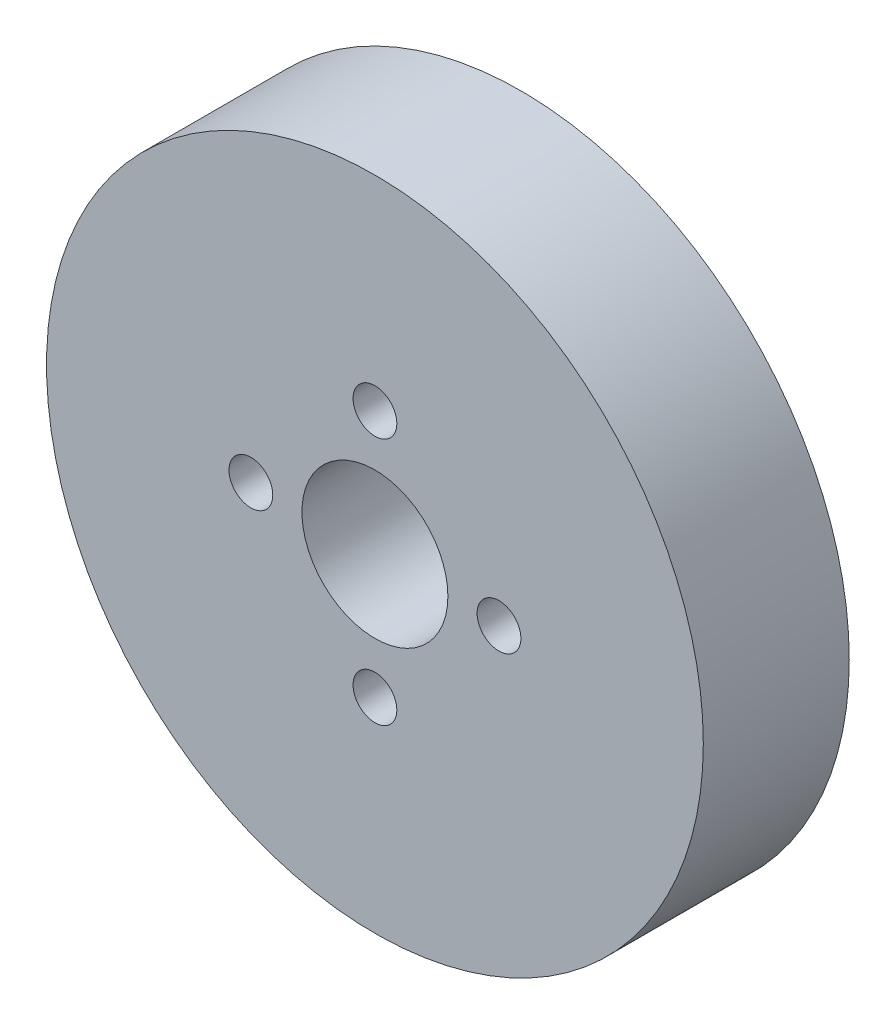
ISO-10303-21;
HEADER;
FILE_DESCRIPTION(('STEP AP214'),'2;1');
FILE_NAME('part.step','',(''),(''),'','','');
FILE_SCHEMA(('AUTOMOTIVE_DESIGN { 1 0 10303 214 1 1 1 1 }'));
ENDSEC;
DATA;
#1=APPLICATION_CONTEXT('core data for automotive mechanical design processes');
#2=APPLICATION_PROTOCOL_DEFINITION('international standard','automotive_design',2000,#1);
#3=PRODUCT_CONTEXT('',#1,'mechanical');
#4=PRODUCT('Part','Part','',(#3));
#5=PRODUCT_RELATED_PRODUCT_CATEGORY('part','',(#4));
#6=PRODUCT_DEFINITION_FORMATION('','',#4);
#7=PRODUCT_DEFINITION_CONTEXT('part definition',#1,'design');
#8=PRODUCT_DEFINITION('design','',#6,#7);
#9=PRODUCT_DEFINITION_SHAPE('','',#8);
#10=(LENGTH_UNIT() NAMED_UNIT(*) SI_UNIT(.MILLI.,.METRE.));
#11=(NAMED_UNIT(*) PLANE_ANGLE_UNIT() SI_UNIT($,.RADIAN.));
#12=(NAMED_UNIT(*) SI_UNIT($,.STERADIAN.) SOLID_ANGLE_UNIT());
#13=UNCERTAINTY_MEASURE_WITH_UNIT(LENGTH_MEASURE(1.E-05),#10,'distance_accuracy_value','');
#14=(GEOMETRIC_REPRESENTATION_CONTEXT(3) GLOBAL_UNCERTAINTY_ASSIGNED_CONTEXT((#13)) GLOBAL_UNIT_ASSIGNED_CONTEXT((#10,
#11,#12)) REPRESENTATION_CONTEXT('',''));
#15=CARTESIAN_POINT('',(0.,0.,0.));
#16=DIRECTION('',(0.,0.,1.));
#17=DIRECTION('',(1.,0.,0.));
#18=AXIS2_PLACEMENT_3D('',#15,#16,#17);
#19=CARTESIAN_POINT('',(0.,0.,10.));
#20=DIRECTION('',(0.,0.,1.));
#21=DIRECTION('',(1.,0.,0.));
#22=AXIS2_PLACEMENT_3D('',#19,#20,#21);
#23=PLANE('',#22);
#24=CARTESIAN_POINT('',(0.,8.5,10.));
#25=DIRECTION('',(0.,0.,1.));
#26=DIRECTION('',(1.,0.,0.));
#27=AXIS2_PLACEMENT_3D('',#24,#25,#26);
#28=CIRCLE('',#27,1.5);
#29=CARTESIAN_POINT('',(1.5,8.5,10.));
#30=VERTEX_POINT('',#29);
#31=EDGE_CURVE('E72',#30,#30,#28,.T.);
#32=ORIENTED_EDGE('',*,*,#31,.F.);
#33=EDGE_LOOP('',(#32));
#34=FACE_BOUND('',#33,.T.);
#35=CARTESIAN_POINT('',(8.50000000000023,2.26424574173893E-13,10.));
#36=DIRECTION('',(0.,0.,1.));
#37=DIRECTION('',(1.,0.,0.));
#38=AXIS2_PLACEMENT_3D('',#35,#36,#37);
#39=CIRCLE('',#38,1.5);
#40=CARTESIAN_POINT('',(10.0000000000002,2.26424574173893E-13,10.));
#41=VERTEX_POINT('',#40);
#42=EDGE_CURVE('E66',#41,#41,#39,.T.);
#43=ORIENTED_EDGE('',*,*,#42,.F.);
#44=EDGE_LOOP('',(#43));
#45=FACE_BOUND('',#44,.T.);
#46=CARTESIAN_POINT('',(4.52849148347786E-13,-8.5,10.));
#47=DIRECTION('',(0.,0.,1.));
#48=DIRECTION('',(1.,0.,0.));
#49=AXIS2_PLACEMENT_3D('',#46,#47,#48);
#50=CIRCLE('',#49,1.5);
#51=CARTESIAN_POINT('',(1.50000000000045,-8.5,10.));
#52=VERTEX_POINT('',#51);
#53=EDGE_CURVE('E60',#52,#52,#50,.T.);
#54=ORIENTED_EDGE('',*,*,#53,.F.);
#55=EDGE_LOOP('',(#54));
#56=FACE_BOUND('',#55,.T.);
#57=CARTESIAN_POINT('',(-8.49999999999977,-2.25383624394618E-13,10.));
#58=DIRECTION('',(0.,0.,1.));
#59=DIRECTION('',(1.,0.,0.));
#60=AXIS2_PLACEMENT_3D('',#57,#58,#59);
#61=CIRCLE('',#60,1.5);
#62=CARTESIAN_POINT('',(-6.99999999999978,-2.25383624394618E-13,10.));
#63=VERTEX_POINT('',#62);
#64=EDGE_CURVE('E54',#63,#63,#61,.T.);
#65=ORIENTED_EDGE('',*,*,#64,.F.);
#66=EDGE_LOOP('',(#65));
#67=FACE_BOUND('',#66,.T.);
#68=CARTESIAN_POINT('',(0.,0.,10.));
#69=DIRECTION('',(0.,0.,1.));
#70=DIRECTION('',(1.,0.,0.));
#71=AXIS2_PLACEMENT_3D('',#68,#69,#70);
#72=CIRCLE('',#71,22.5);
#73=CARTESIAN_POINT('',(22.5,0.,10.));
#74=VERTEX_POINT('',#73);
#75=EDGE_CURVE('E10',#74,#74,#72,.T.);
#76=ORIENTED_EDGE('',*,*,#75,.T.);
#77=EDGE_LOOP('',(#76));
#78=FACE_BOUND('',#77,.T.);
#79=CARTESIAN_POINT('',(0.,0.,10.));
#80=DIRECTION('',(0.,0.,1.));
#81=DIRECTION('',(1.,0.,0.));
#82=AXIS2_PLACEMENT_3D('',#79,#80,#81);
#83=CIRCLE('',#82,5.);
#84=CARTESIAN_POINT('',(5.,0.,10.));
#85=VERTEX_POINT('',#84);
#86=EDGE_CURVE('E44',#85,#85,#83,.T.);
#87=ORIENTED_EDGE('',*,*,#86,.F.);
#88=EDGE_LOOP('',(#87));
#89=FACE_BOUND('',#88,.T.);
#90=ADVANCED_FACE('F33',(#34,#45,#56,#67,#78,#89),#23,.T.);
#91=CARTESIAN_POINT('',(0.,0.,0.));
#92=DIRECTION('',(0.,0.,1.));
#93=DIRECTION('',(1.,0.,0.));
#94=AXIS2_PLACEMENT_3D('',#91,#92,#93);
#95=PLANE('',#94);
#96=CARTESIAN_POINT('',(0.,8.5,0.));
#97=DIRECTION('',(0.,0.,1.));
#98=DIRECTION('',(1.,0.,0.));
#99=AXIS2_PLACEMENT_3D('',#96,#97,#98);
#100=CIRCLE('',#99,1.5);
#101=CARTESIAN_POINT('',(1.5,8.5,0.));
#102=VERTEX_POINT('',#101);
#103=EDGE_CURVE('E69',#102,#102,#100,.T.);
#104=ORIENTED_EDGE('',*,*,#103,.T.);
#105=EDGE_LOOP('',(#104));
#106=FACE_BOUND('',#105,.T.);
#107=CARTESIAN_POINT('',(8.50000000000023,2.26424574173893E-13,0.));
#108=DIRECTION('',(0.,0.,1.));
#109=DIRECTION('',(1.,0.,0.));
#110=AXIS2_PLACEMENT_3D('',#107,#108,#109);
#111=CIRCLE('',#110,1.5);
#112=CARTESIAN_POINT('',(10.0000000000002,2.26424574173893E-13,0.));
#113=VERTEX_POINT('',#112);
#114=EDGE_CURVE('E63',#113,#113,#111,.T.);
#115=ORIENTED_EDGE('',*,*,#114,.T.);
#116=EDGE_LOOP('',(#115));
#117=FACE_BOUND('',#116,.T.);
#118=CARTESIAN_POINT('',(4.52849148347786E-13,-8.5,0.));
#119=DIRECTION('',(0.,0.,1.));
#120=DIRECTION('',(1.,0.,0.));
#121=AXIS2_PLACEMENT_3D('',#118,#119,#120);
#122=CIRCLE('',#121,1.5);
#123=CARTESIAN_POINT('',(1.50000000000045,-8.5,0.));
#124=VERTEX_POINT('',#123);
#125=EDGE_CURVE('E57',#124,#124,#122,.T.);
#126=ORIENTED_EDGE('',*,*,#125,.T.);
#127=EDGE_LOOP('',(#126));
#128=FACE_BOUND('',#127,.T.);
#129=CARTESIAN_POINT('',(-8.49999999999977,-2.25383624394618E-13,0.));
#130=DIRECTION('',(0.,0.,1.));
#131=DIRECTION('',(1.,0.,0.));
#132=AXIS2_PLACEMENT_3D('',#129,#130,#131);
#133=CIRCLE('',#132,1.5);
#134=CARTESIAN_POINT('',(-6.99999999999978,-2.25383624394618E-13,0.));
#135=VERTEX_POINT('',#134);
#136=EDGE_CURVE('E49',#135,#135,#133,.T.);
#137=ORIENTED_EDGE('',*,*,#136,.T.);
#138=EDGE_LOOP('',(#137));
#139=FACE_BOUND('',#138,.T.);
#140=CARTESIAN_POINT('',(0.,0.,0.));
#141=DIRECTION('',(0.,0.,1.));
#142=DIRECTION('',(1.,0.,0.));
#143=AXIS2_PLACEMENT_3D('',#140,#141,#142);
#144=CIRCLE('',#143,22.5);
#145=CARTESIAN_POINT('',(22.5,0.,0.));
#146=VERTEX_POINT('',#145);
#147=EDGE_CURVE('E37',#146,#146,#144,.T.);
#148=ORIENTED_EDGE('',*,*,#147,.F.);
#149=EDGE_LOOP('',(#148));
#150=FACE_BOUND('',#149,.T.);
#151=CARTESIAN_POINT('',(0.,0.,0.));
#152=DIRECTION('',(0.,0.,1.));
#153=DIRECTION('',(1.,0.,0.));
#154=AXIS2_PLACEMENT_3D('',#151,#152,#153);
#155=CIRCLE('',#154,5.);
#156=CARTESIAN_POINT('',(5.,0.,0.));
#157=VERTEX_POINT('',#156);
#158=EDGE_CURVE('E46',#157,#157,#155,.T.);
#159=ORIENTED_EDGE('',*,*,#158,.T.);
#160=EDGE_LOOP('',(#159));
#161=FACE_BOUND('',#160,.T.);
#162=ADVANCED_FACE('F80',(#106,#117,#128,#139,#150,#161),#95,.F.);
#163=CARTESIAN_POINT('',(0.,0.,10.));
#164=DIRECTION('',(0.,0.,-1.));
#165=DIRECTION('',(-1.,0.,0.));
#166=AXIS2_PLACEMENT_3D('',#163,#164,#165);
#167=CYLINDRICAL_SURFACE('',#166,22.5);
#168=ORIENTED_EDGE('',*,*,#75,.F.);
#169=EDGE_LOOP('',(#168));
#170=FACE_BOUND('',#169,.T.);
#171=ORIENTED_EDGE('',*,*,#147,.T.);
#172=EDGE_LOOP('',(#171));
#173=FACE_BOUND('',#172,.T.);
#174=ADVANCED_FACE('F35',(#170,#173),#167,.T.);
#175=CARTESIAN_POINT('',(0.,0.,10.));
#176=DIRECTION('',(0.,0.,-1.));
#177=DIRECTION('',(-1.,0.,0.));
#178=AXIS2_PLACEMENT_3D('',#175,#176,#177);
#179=CYLINDRICAL_SURFACE('',#178,5.);
#180=ORIENTED_EDGE('',*,*,#86,.T.);
#181=EDGE_LOOP('',(#180));
#182=FACE_BOUND('',#181,.T.);
#183=ORIENTED_EDGE('',*,*,#158,.F.);
#184=EDGE_LOOP('',(#183));
#185=FACE_BOUND('',#184,.T.);
#186=ADVANCED_FACE('F90',(#182,#185),#179,.F.);
#187=CARTESIAN_POINT('',(-8.49999999999977,-2.25383624394618E-13,10.));
#188=DIRECTION('',(0.,0.,1.));
#189=DIRECTION('',(1.,0.,0.));
#190=AXIS2_PLACEMENT_3D('',#187,#188,#189);
#191=CYLINDRICAL_SURFACE('',#190,1.5);
#192=ORIENTED_EDGE('',*,*,#136,.F.);
#193=EDGE_LOOP('',(#192));
#194=FACE_BOUND('',#193,.T.);
#195=ORIENTED_EDGE('',*,*,#64,.T.);
#196=EDGE_LOOP('',(#195));
#197=FACE_BOUND('',#196,.T.);
#198=ADVANCED_FACE('F93',(#194,#197),#191,.F.);
#199=CARTESIAN_POINT('',(4.52849148347786E-13,-8.5,10.));
#200=DIRECTION('',(0.,0.,1.));
#201=DIRECTION('',(1.,0.,0.));
#202=AXIS2_PLACEMENT_3D('',#199,#200,#201);
#203=CYLINDRICAL_SURFACE('',#202,1.5);
#204=ORIENTED_EDGE('',*,*,#125,.F.);
#205=EDGE_LOOP('',(#204));
#206=FACE_BOUND('',#205,.T.);
#207=ORIENTED_EDGE('',*,*,#53,.T.);
#208=EDGE_LOOP('',(#207));
#209=FACE_BOUND('',#208,.T.);
#210=ADVANCED_FACE('F107',(#206,#209),#203,.F.);
#211=CARTESIAN_POINT('',(8.50000000000023,2.26424574173893E-13,10.));
#212=DIRECTION('',(0.,0.,1.));
#213=DIRECTION('',(1.,0.,0.));
#214=AXIS2_PLACEMENT_3D('',#211,#212,#213);
#215=CYLINDRICAL_SURFACE('',#214,1.5);
#216=ORIENTED_EDGE('',*,*,#114,.F.);
#217=EDGE_LOOP('',(#216));
#218=FACE_BOUND('',#217,.T.);
#219=ORIENTED_EDGE('',*,*,#42,.T.);
#220=EDGE_LOOP('',(#219));
#221=FACE_BOUND('',#220,.T.);
#222=ADVANCED_FACE('F111',(#218,#221),#215,.F.);
#223=CARTESIAN_POINT('',(0.,8.5,10.));
#224=DIRECTION('',(0.,0.,1.));
#225=DIRECTION('',(1.,0.,0.));
#226=AXIS2_PLACEMENT_3D('',#223,#224,#225);
#227=CYLINDRICAL_SURFACE('',#226,1.5);
#228=ORIENTED_EDGE('',*,*,#103,.F.);
#229=EDGE_LOOP('',(#228));
#230=FACE_BOUND('',#229,.T.);
#231=ORIENTED_EDGE('',*,*,#31,.T.);
#232=EDGE_LOOP('',(#231));
#233=FACE_BOUND('',#232,.T.);
#234=ADVANCED_FACE('F76',(#230,#233),#227,.F.);
#235=CLOSED_SHELL('',(#90,#162,#174,#186,#198,#210,#222,#234));
#236=MANIFOLD_SOLID_BREP('B2',#235);
#237=ADVANCED_BREP_SHAPE_REPRESENTATION('',(#18,#236),#14);
#238=SHAPE_DEFINITION_REPRESENTATION(#9,#237);
ENDSEC;
END-ISO-10303-21;
